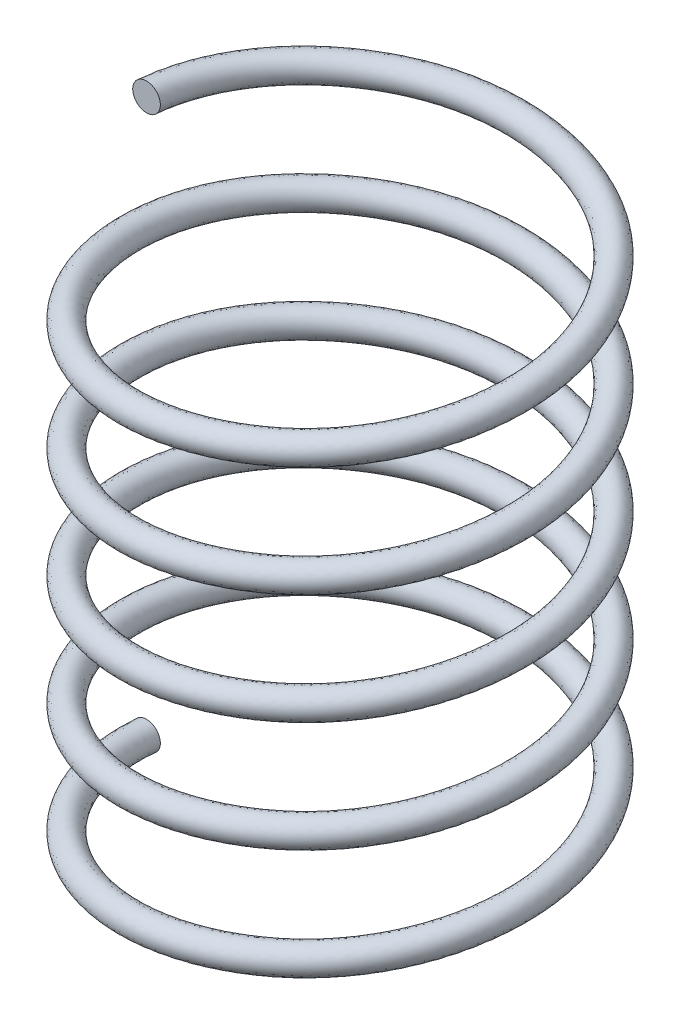
ISO-10303-21;
HEADER;
FILE_DESCRIPTION(('STEP AP214'),'2;1');
FILE_NAME('part.step','',(''),(''),'','','');
FILE_SCHEMA(('AUTOMOTIVE_DESIGN { 1 0 10303 214 1 1 1 1 }'));
ENDSEC;
DATA;
#1=APPLICATION_CONTEXT('core data for automotive mechanical design processes');
#2=APPLICATION_PROTOCOL_DEFINITION('international standard','automotive_design',2000,#1);
#3=PRODUCT_CONTEXT('',#1,'mechanical');
#4=PRODUCT('Part','Part','',(#3));
#5=PRODUCT_RELATED_PRODUCT_CATEGORY('part','',(#4));
#6=PRODUCT_DEFINITION_FORMATION('','',#4);
#7=PRODUCT_DEFINITION_CONTEXT('part definition',#1,'design');
#8=PRODUCT_DEFINITION('design','',#6,#7);
#9=PRODUCT_DEFINITION_SHAPE('','',#8);
#10=(LENGTH_UNIT() NAMED_UNIT(*) SI_UNIT(.MILLI.,.METRE.));
#11=(NAMED_UNIT(*) PLANE_ANGLE_UNIT() SI_UNIT($,.RADIAN.));
#12=(NAMED_UNIT(*) SI_UNIT($,.STERADIAN.) SOLID_ANGLE_UNIT());
#13=UNCERTAINTY_MEASURE_WITH_UNIT(LENGTH_MEASURE(1.E-05),#10,'distance_accuracy_value','');
#14=(GEOMETRIC_REPRESENTATION_CONTEXT(3) GLOBAL_UNCERTAINTY_ASSIGNED_CONTEXT((#13)) GLOBAL_UNIT_ASSIGNED_CONTEXT((#10,
#11,#12)) REPRESENTATION_CONTEXT('',''));
#15=CARTESIAN_POINT('',(0.,0.,0.));
#16=DIRECTION('',(0.,0.,1.));
#17=DIRECTION('',(1.,0.,0.));
#18=AXIS2_PLACEMENT_3D('',#15,#16,#17);
#19=CARTESIAN_POINT('',(0.,0.,0.));
#20=DIRECTION('',(0.,0.,1.));
#21=DIRECTION('',(1.,0.,0.));
#22=AXIS2_PLACEMENT_3D('',#19,#20,#21);
#23=PLANE('',#22);
#24=CARTESIAN_POINT('',(0.,0.,0.));
#25=DIRECTION('',(0.,0.,1.));
#26=DIRECTION('',(1.,0.,0.));
#27=AXIS2_PLACEMENT_3D('',#24,#25,#26);
#28=CIRCLE('',#27,0.5);
#29=CARTESIAN_POINT('',(0.5,0.,0.));
#30=VERTEX_POINT('',#29);
#31=EDGE_CURVE('E42',#30,#30,#28,.T.);
#32=ORIENTED_EDGE('',*,*,#31,.F.);
#33=EDGE_LOOP('',(#32));
#34=FACE_BOUND('',#33,.T.);
#35=ADVANCED_FACE('F35',(#34),#23,.F.);
#36=CARTESIAN_POINT('',(0.,20.,4.88807387438039E-13));
#37=DIRECTION('',(0.,0.,1.));
#38=DIRECTION('',(1.,0.,0.));
#39=AXIS2_PLACEMENT_3D('',#36,#37,#38);
#40=PLANE('',#39);
#41=CARTESIAN_POINT('',(0.,20.,4.88807387438039E-13));
#42=DIRECTION('',(0.,0.,1.));
#43=DIRECTION('',(1.,0.,0.));
#44=AXIS2_PLACEMENT_3D('',#41,#42,#43);
#45=CIRCLE('',#44,0.5);
#46=CARTESIAN_POINT('',(0.5,20.,4.53892574049607E-13));
#47=VERTEX_POINT('',#46);
#48=EDGE_CURVE('E11',#47,#47,#45,.T.);
#49=ORIENTED_EDGE('',*,*,#48,.T.);
#50=EDGE_LOOP('',(#49));
#51=FACE_BOUND('',#50,.T.);
#52=ADVANCED_FACE('F49',(#51),#40,.T.);
#53=CARTESIAN_POINT('',(0.5,0.,0.));
#54=CARTESIAN_POINT('',(0.5,0.333333333333333,3.75277674973257));
#55=CARTESIAN_POINT('',(3.75,0.666666666666665,5.62916512459885));
#56=CARTESIAN_POINT('',(7.,0.999999999999998,7.50555349946513));
#57=CARTESIAN_POINT('',(10.25,1.33333333333333,5.62916512459885));
#58=CARTESIAN_POINT('',(13.5,1.66666666666666,3.75277674973257));
#59=CARTESIAN_POINT('',(13.5,2.,0.));
#60=CARTESIAN_POINT('',(13.5,2.33333333333333,-3.75277674973257));
#61=CARTESIAN_POINT('',(10.25,2.66666666666666,-5.62916512459885));
#62=CARTESIAN_POINT('',(7.,2.99999999999999,-7.50555349946513));
#63=CARTESIAN_POINT('',(3.75000000000001,3.33333333333333,-5.62916512459885));
#64=CARTESIAN_POINT('',(0.500000000000002,3.66666666666666,-3.75277674973257));
#65=CARTESIAN_POINT('',(0.5,3.99999999999999,0.));
#66=CARTESIAN_POINT('',(0.5,4.33333333333332,3.75277674973257));
#67=CARTESIAN_POINT('',(3.75,4.66666666666666,5.62916512459885));
#68=CARTESIAN_POINT('',(7.,4.99999999999999,7.50555349946513));
#69=CARTESIAN_POINT('',(10.25,5.33333333333332,5.62916512459885));
#70=CARTESIAN_POINT('',(13.5,5.66666666666665,3.75277674973257));
#71=CARTESIAN_POINT('',(13.5,5.99999999999999,0.));
#72=CARTESIAN_POINT('',(13.5,6.33333333333332,-3.75277674973257));
#73=CARTESIAN_POINT('',(10.25,6.66666666666665,-5.62916512459885));
#74=CARTESIAN_POINT('',(7.,6.99999999999998,-7.50555349946513));
#75=CARTESIAN_POINT('',(3.75000000000001,7.33333333333332,-5.62916512459885));
#76=CARTESIAN_POINT('',(0.500000000000002,7.66666666666665,-3.75277674973257));
#77=CARTESIAN_POINT('',(0.5,7.99999999999998,0.));
#78=CARTESIAN_POINT('',(0.5,8.33333333333331,3.75277674973257));
#79=CARTESIAN_POINT('',(3.75,8.66666666666665,5.62916512459885));
#80=CARTESIAN_POINT('',(7.,8.99999999999998,7.50555349946513));
#81=CARTESIAN_POINT('',(10.25,9.33333333333331,5.62916512459885));
#82=CARTESIAN_POINT('',(13.5,9.66666666666664,3.75277674973257));
#83=CARTESIAN_POINT('',(13.5,9.99999999999998,0.));
#84=CARTESIAN_POINT('',(13.5,10.3333333333333,-3.75277674973257));
#85=CARTESIAN_POINT('',(10.25,10.6666666666666,-5.62916512459885));
#86=CARTESIAN_POINT('',(7.,11.,-7.50555349946513));
#87=CARTESIAN_POINT('',(3.75000000000001,11.3333333333333,-5.62916512459885));
#88=CARTESIAN_POINT('',(0.500000000000002,11.6666666666666,-3.75277674973257));
#89=CARTESIAN_POINT('',(0.5,12.,0.));
#90=CARTESIAN_POINT('',(0.5,12.3333333333333,3.75277674973257));
#91=CARTESIAN_POINT('',(3.75,12.6666666666666,5.62916512459885));
#92=CARTESIAN_POINT('',(7.,13.,7.50555349946513));
#93=CARTESIAN_POINT('',(10.25,13.3333333333333,5.62916512459885));
#94=CARTESIAN_POINT('',(13.5,13.6666666666666,3.75277674973257));
#95=CARTESIAN_POINT('',(13.5,14.,0.));
#96=CARTESIAN_POINT('',(13.5,14.3333333333333,-3.75277674973257));
#97=CARTESIAN_POINT('',(10.25,14.6666666666666,-5.62916512459885));
#98=CARTESIAN_POINT('',(7.,15.,-7.50555349946513));
#99=CARTESIAN_POINT('',(3.75000000000001,15.3333333333333,-5.62916512459885));
#100=CARTESIAN_POINT('',(0.500000000000002,15.6666666666666,-3.75277674973257));
#101=CARTESIAN_POINT('',(0.5,16.,0.));
#102=CARTESIAN_POINT('',(0.5,16.3333333333333,3.75277674973257));
#103=CARTESIAN_POINT('',(3.75,16.6666666666666,5.62916512459885));
#104=CARTESIAN_POINT('',(7.,17.,7.50555349946513));
#105=CARTESIAN_POINT('',(10.25,17.3333333333333,5.62916512459885));
#106=CARTESIAN_POINT('',(13.5,17.6666666666666,3.75277674973257));
#107=CARTESIAN_POINT('',(13.5,18.,0.));
#108=CARTESIAN_POINT('',(13.5,18.3333333333333,-3.75277674973257));
#109=CARTESIAN_POINT('',(10.25,18.6666666666666,-5.62916512459885));
#110=CARTESIAN_POINT('',(7.,19.,-7.50555349946513));
#111=CARTESIAN_POINT('',(3.75000000000001,19.3333333333333,-5.62916512459885));
#112=CARTESIAN_POINT('',(0.500000000000002,19.6666666666666,-3.75277674973257));
#113=CARTESIAN_POINT('',(0.5,20.,0.));
#114=CARTESIAN_POINT('',(0.5,1.,0.));
#115=CARTESIAN_POINT('',(0.5,1.33333333333333,3.75277674973257));
#116=CARTESIAN_POINT('',(3.75,1.66666666666666,5.62916512459885));
#117=CARTESIAN_POINT('',(7.,2.,7.50555349946513));
#118=CARTESIAN_POINT('',(10.25,2.33333333333333,5.62916512459885));
#119=CARTESIAN_POINT('',(13.5,2.66666666666666,3.75277674973257));
#120=CARTESIAN_POINT('',(13.5,3.,0.));
#121=CARTESIAN_POINT('',(13.5,3.33333333333333,-3.75277674973257));
#122=CARTESIAN_POINT('',(10.25,3.66666666666666,-5.62916512459885));
#123=CARTESIAN_POINT('',(7.,3.99999999999999,-7.50555349946513));
#124=CARTESIAN_POINT('',(3.75000000000001,4.33333333333333,-5.62916512459885));
#125=CARTESIAN_POINT('',(0.500000000000002,4.66666666666666,-3.75277674973257));
#126=CARTESIAN_POINT('',(0.5,4.99999999999999,0.));
#127=CARTESIAN_POINT('',(0.5,5.33333333333332,3.75277674973257));
#128=CARTESIAN_POINT('',(3.75,5.66666666666666,5.62916512459885));
#129=CARTESIAN_POINT('',(7.,5.99999999999999,7.50555349946513));
#130=CARTESIAN_POINT('',(10.25,6.33333333333332,5.62916512459885));
#131=CARTESIAN_POINT('',(13.5,6.66666666666665,3.75277674973257));
#132=CARTESIAN_POINT('',(13.5,6.99999999999999,0.));
#133=CARTESIAN_POINT('',(13.5,7.33333333333332,-3.75277674973257));
#134=CARTESIAN_POINT('',(10.25,7.66666666666665,-5.62916512459885));
#135=CARTESIAN_POINT('',(7.,7.99999999999998,-7.50555349946513));
#136=CARTESIAN_POINT('',(3.75000000000001,8.33333333333332,-5.62916512459885));
#137=CARTESIAN_POINT('',(0.500000000000002,8.66666666666665,-3.75277674973257));
#138=CARTESIAN_POINT('',(0.5,8.99999999999998,0.));
#139=CARTESIAN_POINT('',(0.5,9.33333333333331,3.75277674973257));
#140=CARTESIAN_POINT('',(3.75,9.66666666666665,5.62916512459885));
#141=CARTESIAN_POINT('',(7.,9.99999999999998,7.50555349946513));
#142=CARTESIAN_POINT('',(10.25,10.3333333333333,5.62916512459885));
#143=CARTESIAN_POINT('',(13.5,10.6666666666666,3.75277674973257));
#144=CARTESIAN_POINT('',(13.5,11.,0.));
#145=CARTESIAN_POINT('',(13.5,11.3333333333333,-3.75277674973257));
#146=CARTESIAN_POINT('',(10.25,11.6666666666666,-5.62916512459885));
#147=CARTESIAN_POINT('',(7.,12.,-7.50555349946513));
#148=CARTESIAN_POINT('',(3.75000000000001,12.3333333333333,-5.62916512459885));
#149=CARTESIAN_POINT('',(0.500000000000002,12.6666666666666,-3.75277674973257));
#150=CARTESIAN_POINT('',(0.5,13.,0.));
#151=CARTESIAN_POINT('',(0.5,13.3333333333333,3.75277674973257));
#152=CARTESIAN_POINT('',(3.75,13.6666666666666,5.62916512459885));
#153=CARTESIAN_POINT('',(7.,14.,7.50555349946513));
#154=CARTESIAN_POINT('',(10.25,14.3333333333333,5.62916512459885));
#155=CARTESIAN_POINT('',(13.5,14.6666666666666,3.75277674973257));
#156=CARTESIAN_POINT('',(13.5,15.,0.));
#157=CARTESIAN_POINT('',(13.5,15.3333333333333,-3.75277674973257));
#158=CARTESIAN_POINT('',(10.25,15.6666666666666,-5.62916512459885));
#159=CARTESIAN_POINT('',(7.,16.,-7.50555349946513));
#160=CARTESIAN_POINT('',(3.75000000000001,16.3333333333333,-5.62916512459885));
#161=CARTESIAN_POINT('',(0.500000000000002,16.6666666666666,-3.75277674973257));
#162=CARTESIAN_POINT('',(0.5,17.,0.));
#163=CARTESIAN_POINT('',(0.5,17.3333333333333,3.75277674973257));
#164=CARTESIAN_POINT('',(3.75,17.6666666666666,5.62916512459885));
#165=CARTESIAN_POINT('',(7.,18.,7.50555349946513));
#166=CARTESIAN_POINT('',(10.25,18.3333333333333,5.62916512459885));
#167=CARTESIAN_POINT('',(13.5,18.6666666666666,3.75277674973257));
#168=CARTESIAN_POINT('',(13.5,19.,0.));
#169=CARTESIAN_POINT('',(13.5,19.3333333333333,-3.75277674973257));
#170=CARTESIAN_POINT('',(10.25,19.6666666666666,-5.62916512459885));
#171=CARTESIAN_POINT('',(7.,20.,-7.50555349946513));
#172=CARTESIAN_POINT('',(3.75000000000001,20.3333333333333,-5.62916512459885));
#173=CARTESIAN_POINT('',(0.500000000000002,20.6666666666666,-3.75277674973257));
#174=CARTESIAN_POINT('',(0.5,21.,0.));
#175=CARTESIAN_POINT('',(-0.5,1.,0.));
#176=CARTESIAN_POINT('',(-0.5,1.33333333333333,4.33012701892219));
#177=CARTESIAN_POINT('',(3.25,1.66666666666666,6.49519052838329));
#178=CARTESIAN_POINT('',(7.,2.,8.66025403784439));
#179=CARTESIAN_POINT('',(10.75,2.33333333333333,6.49519052838329));
#180=CARTESIAN_POINT('',(14.5,2.66666666666666,4.3301270189222));
#181=CARTESIAN_POINT('',(14.5,3.,0.));
#182=CARTESIAN_POINT('',(14.5,3.33333333333333,-4.33012701892219));
#183=CARTESIAN_POINT('',(10.75,3.66666666666666,-6.49519052838329));
#184=CARTESIAN_POINT('',(7.,3.99999999999999,-8.66025403784439));
#185=CARTESIAN_POINT('',(3.25000000000001,4.33333333333333,-6.49519052838329));
#186=CARTESIAN_POINT('',(-0.499999999999997,4.66666666666666,-4.3301270189222));
#187=CARTESIAN_POINT('',(-0.5,4.99999999999999,0.));
#188=CARTESIAN_POINT('',(-0.5,5.33333333333332,4.33012701892219));
#189=CARTESIAN_POINT('',(3.25,5.66666666666666,6.49519052838329));
#190=CARTESIAN_POINT('',(7.,5.99999999999999,8.66025403784439));
#191=CARTESIAN_POINT('',(10.75,6.33333333333332,6.49519052838329));
#192=CARTESIAN_POINT('',(14.5,6.66666666666665,4.3301270189222));
#193=CARTESIAN_POINT('',(14.5,6.99999999999999,0.));
#194=CARTESIAN_POINT('',(14.5,7.33333333333332,-4.33012701892219));
#195=CARTESIAN_POINT('',(10.75,7.66666666666665,-6.49519052838329));
#196=CARTESIAN_POINT('',(7.,7.99999999999998,-8.66025403784439));
#197=CARTESIAN_POINT('',(3.25000000000001,8.33333333333332,-6.49519052838329));
#198=CARTESIAN_POINT('',(-0.499999999999997,8.66666666666665,-4.3301270189222));
#199=CARTESIAN_POINT('',(-0.5,8.99999999999998,0.));
#200=CARTESIAN_POINT('',(-0.5,9.33333333333331,4.33012701892219));
#201=CARTESIAN_POINT('',(3.25,9.66666666666665,6.49519052838329));
#202=CARTESIAN_POINT('',(7.,9.99999999999998,8.66025403784439));
#203=CARTESIAN_POINT('',(10.75,10.3333333333333,6.49519052838329));
#204=CARTESIAN_POINT('',(14.5,10.6666666666666,4.3301270189222));
#205=CARTESIAN_POINT('',(14.5,11.,0.));
#206=CARTESIAN_POINT('',(14.5,11.3333333333333,-4.33012701892219));
#207=CARTESIAN_POINT('',(10.75,11.6666666666666,-6.49519052838329));
#208=CARTESIAN_POINT('',(7.,12.,-8.66025403784439));
#209=CARTESIAN_POINT('',(3.25000000000001,12.3333333333333,-6.49519052838329));
#210=CARTESIAN_POINT('',(-0.499999999999997,12.6666666666666,-4.3301270189222));
#211=CARTESIAN_POINT('',(-0.5,13.,0.));
#212=CARTESIAN_POINT('',(-0.5,13.3333333333333,4.33012701892219));
#213=CARTESIAN_POINT('',(3.25,13.6666666666666,6.49519052838329));
#214=CARTESIAN_POINT('',(7.,14.,8.66025403784439));
#215=CARTESIAN_POINT('',(10.75,14.3333333333333,6.49519052838329));
#216=CARTESIAN_POINT('',(14.5,14.6666666666666,4.3301270189222));
#217=CARTESIAN_POINT('',(14.5,15.,0.));
#218=CARTESIAN_POINT('',(14.5,15.3333333333333,-4.33012701892219));
#219=CARTESIAN_POINT('',(10.75,15.6666666666666,-6.49519052838329));
#220=CARTESIAN_POINT('',(7.,16.,-8.66025403784439));
#221=CARTESIAN_POINT('',(3.25000000000001,16.3333333333333,-6.49519052838329));
#222=CARTESIAN_POINT('',(-0.499999999999997,16.6666666666666,-4.3301270189222));
#223=CARTESIAN_POINT('',(-0.5,17.,0.));
#224=CARTESIAN_POINT('',(-0.5,17.3333333333333,4.33012701892219));
#225=CARTESIAN_POINT('',(3.25,17.6666666666666,6.49519052838329));
#226=CARTESIAN_POINT('',(7.,18.,8.66025403784439));
#227=CARTESIAN_POINT('',(10.75,18.3333333333333,6.49519052838329));
#228=CARTESIAN_POINT('',(14.5,18.6666666666666,4.3301270189222));
#229=CARTESIAN_POINT('',(14.5,19.,0.));
#230=CARTESIAN_POINT('',(14.5,19.3333333333333,-4.33012701892219));
#231=CARTESIAN_POINT('',(10.75,19.6666666666666,-6.49519052838329));
#232=CARTESIAN_POINT('',(7.,20.,-8.66025403784439));
#233=CARTESIAN_POINT('',(3.25000000000001,20.3333333333333,-6.49519052838329));
#234=CARTESIAN_POINT('',(-0.499999999999997,20.6666666666666,-4.3301270189222));
#235=CARTESIAN_POINT('',(-0.5,21.,0.));
#236=CARTESIAN_POINT('',(-0.5,0.,0.));
#237=CARTESIAN_POINT('',(-0.5,0.333333333333333,4.33012701892219));
#238=CARTESIAN_POINT('',(3.25,0.666666666666665,6.49519052838329));
#239=CARTESIAN_POINT('',(7.,0.999999999999998,8.66025403784439));
#240=CARTESIAN_POINT('',(10.75,1.33333333333333,6.49519052838329));
#241=CARTESIAN_POINT('',(14.5,1.66666666666666,4.3301270189222));
#242=CARTESIAN_POINT('',(14.5,2.,0.));
#243=CARTESIAN_POINT('',(14.5,2.33333333333333,-4.33012701892219));
#244=CARTESIAN_POINT('',(10.75,2.66666666666666,-6.49519052838329));
#245=CARTESIAN_POINT('',(7.,2.99999999999999,-8.66025403784439));
#246=CARTESIAN_POINT('',(3.25000000000001,3.33333333333333,-6.49519052838329));
#247=CARTESIAN_POINT('',(-0.499999999999998,3.66666666666666,-4.3301270189222));
#248=CARTESIAN_POINT('',(-0.5,3.99999999999999,0.));
#249=CARTESIAN_POINT('',(-0.5,4.33333333333332,4.33012701892219));
#250=CARTESIAN_POINT('',(3.25,4.66666666666666,6.49519052838329));
#251=CARTESIAN_POINT('',(7.,4.99999999999999,8.66025403784439));
#252=CARTESIAN_POINT('',(10.75,5.33333333333332,6.49519052838329));
#253=CARTESIAN_POINT('',(14.5,5.66666666666665,4.3301270189222));
#254=CARTESIAN_POINT('',(14.5,5.99999999999999,0.));
#255=CARTESIAN_POINT('',(14.5,6.33333333333332,-4.33012701892219));
#256=CARTESIAN_POINT('',(10.75,6.66666666666665,-6.49519052838329));
#257=CARTESIAN_POINT('',(7.,6.99999999999998,-8.66025403784439));
#258=CARTESIAN_POINT('',(3.25000000000001,7.33333333333332,-6.49519052838329));
#259=CARTESIAN_POINT('',(-0.499999999999998,7.66666666666665,-4.3301270189222));
#260=CARTESIAN_POINT('',(-0.5,7.99999999999998,0.));
#261=CARTESIAN_POINT('',(-0.5,8.33333333333331,4.33012701892219));
#262=CARTESIAN_POINT('',(3.25,8.66666666666665,6.49519052838329));
#263=CARTESIAN_POINT('',(7.,8.99999999999998,8.66025403784439));
#264=CARTESIAN_POINT('',(10.75,9.33333333333331,6.49519052838329));
#265=CARTESIAN_POINT('',(14.5,9.66666666666664,4.3301270189222));
#266=CARTESIAN_POINT('',(14.5,9.99999999999998,0.));
#267=CARTESIAN_POINT('',(14.5,10.3333333333333,-4.33012701892219));
#268=CARTESIAN_POINT('',(10.75,10.6666666666666,-6.49519052838329));
#269=CARTESIAN_POINT('',(7.,11.,-8.66025403784439));
#270=CARTESIAN_POINT('',(3.25000000000001,11.3333333333333,-6.49519052838329));
#271=CARTESIAN_POINT('',(-0.499999999999998,11.6666666666666,-4.3301270189222));
#272=CARTESIAN_POINT('',(-0.5,12.,0.));
#273=CARTESIAN_POINT('',(-0.5,12.3333333333333,4.33012701892219));
#274=CARTESIAN_POINT('',(3.25,12.6666666666666,6.49519052838329));
#275=CARTESIAN_POINT('',(7.,13.,8.66025403784439));
#276=CARTESIAN_POINT('',(10.75,13.3333333333333,6.49519052838329));
#277=CARTESIAN_POINT('',(14.5,13.6666666666666,4.3301270189222));
#278=CARTESIAN_POINT('',(14.5,14.,0.));
#279=CARTESIAN_POINT('',(14.5,14.3333333333333,-4.33012701892219));
#280=CARTESIAN_POINT('',(10.75,14.6666666666666,-6.49519052838329));
#281=CARTESIAN_POINT('',(7.,15.,-8.66025403784439));
#282=CARTESIAN_POINT('',(3.25000000000001,15.3333333333333,-6.49519052838329));
#283=CARTESIAN_POINT('',(-0.499999999999998,15.6666666666666,-4.3301270189222));
#284=CARTESIAN_POINT('',(-0.5,16.,0.));
#285=CARTESIAN_POINT('',(-0.5,16.3333333333333,4.33012701892219));
#286=CARTESIAN_POINT('',(3.25,16.6666666666666,6.49519052838329));
#287=CARTESIAN_POINT('',(7.,17.,8.66025403784439));
#288=CARTESIAN_POINT('',(10.75,17.3333333333333,6.49519052838329));
#289=CARTESIAN_POINT('',(14.5,17.6666666666666,4.3301270189222));
#290=CARTESIAN_POINT('',(14.5,18.,0.));
#291=CARTESIAN_POINT('',(14.5,18.3333333333333,-4.33012701892219));
#292=CARTESIAN_POINT('',(10.75,18.6666666666666,-6.49519052838329));
#293=CARTESIAN_POINT('',(7.,19.,-8.66025403784439));
#294=CARTESIAN_POINT('',(3.25000000000001,19.3333333333333,-6.49519052838329));
#295=CARTESIAN_POINT('',(-0.499999999999998,19.6666666666666,-4.3301270189222));
#296=CARTESIAN_POINT('',(-0.5,20.,0.));
#297=CARTESIAN_POINT('',(-0.5,-1.,0.));
#298=CARTESIAN_POINT('',(-0.5,-0.666666666666667,4.33012701892219));
#299=CARTESIAN_POINT('',(3.25,-0.333333333333335,6.49519052838329));
#300=CARTESIAN_POINT('',(7.,0.,8.66025403784439));
#301=CARTESIAN_POINT('',(10.75,0.33333333333333,6.49519052838329));
#302=CARTESIAN_POINT('',(14.5,0.666666666666663,4.3301270189222));
#303=CARTESIAN_POINT('',(14.5,0.999999999999995,0.));
#304=CARTESIAN_POINT('',(14.5,1.33333333333333,-4.33012701892219));
#305=CARTESIAN_POINT('',(10.75,1.66666666666666,-6.49519052838329));
#306=CARTESIAN_POINT('',(7.,1.99999999999999,-8.66025403784439));
#307=CARTESIAN_POINT('',(3.25000000000001,2.33333333333333,-6.49519052838329));
#308=CARTESIAN_POINT('',(-0.499999999999998,2.66666666666666,-4.3301270189222));
#309=CARTESIAN_POINT('',(-0.5,2.99999999999999,0.));
#310=CARTESIAN_POINT('',(-0.5,3.33333333333332,4.33012701892219));
#311=CARTESIAN_POINT('',(3.25,3.66666666666666,6.49519052838329));
#312=CARTESIAN_POINT('',(7.,3.99999999999999,8.66025403784439));
#313=CARTESIAN_POINT('',(10.75,4.33333333333332,6.49519052838329));
#314=CARTESIAN_POINT('',(14.5,4.66666666666665,4.3301270189222));
#315=CARTESIAN_POINT('',(14.5,4.99999999999999,0.));
#316=CARTESIAN_POINT('',(14.5,5.33333333333332,-4.33012701892219));
#317=CARTESIAN_POINT('',(10.75,5.66666666666665,-6.49519052838329));
#318=CARTESIAN_POINT('',(7.,5.99999999999998,-8.66025403784439));
#319=CARTESIAN_POINT('',(3.25000000000001,6.33333333333332,-6.49519052838329));
#320=CARTESIAN_POINT('',(-0.499999999999998,6.66666666666665,-4.3301270189222));
#321=CARTESIAN_POINT('',(-0.5,6.99999999999998,0.));
#322=CARTESIAN_POINT('',(-0.5,7.33333333333332,4.33012701892219));
#323=CARTESIAN_POINT('',(3.25,7.66666666666665,6.49519052838329));
#324=CARTESIAN_POINT('',(7.,7.99999999999998,8.66025403784439));
#325=CARTESIAN_POINT('',(10.75,8.33333333333331,6.49519052838329));
#326=CARTESIAN_POINT('',(14.5,8.66666666666665,4.3301270189222));
#327=CARTESIAN_POINT('',(14.5,8.99999999999998,0.));
#328=CARTESIAN_POINT('',(14.5,9.33333333333331,-4.33012701892219));
#329=CARTESIAN_POINT('',(10.75,9.66666666666664,-6.49519052838329));
#330=CARTESIAN_POINT('',(7.,9.99999999999998,-8.66025403784439));
#331=CARTESIAN_POINT('',(3.25000000000001,10.3333333333333,-6.49519052838329));
#332=CARTESIAN_POINT('',(-0.499999999999998,10.6666666666666,-4.3301270189222));
#333=CARTESIAN_POINT('',(-0.5,11.,0.));
#334=CARTESIAN_POINT('',(-0.5,11.3333333333333,4.33012701892219));
#335=CARTESIAN_POINT('',(3.25,11.6666666666666,6.49519052838329));
#336=CARTESIAN_POINT('',(7.,12.,8.66025403784439));
#337=CARTESIAN_POINT('',(10.75,12.3333333333333,6.49519052838329));
#338=CARTESIAN_POINT('',(14.5,12.6666666666666,4.3301270189222));
#339=CARTESIAN_POINT('',(14.5,13.,0.));
#340=CARTESIAN_POINT('',(14.5,13.3333333333333,-4.33012701892219));
#341=CARTESIAN_POINT('',(10.75,13.6666666666666,-6.49519052838329));
#342=CARTESIAN_POINT('',(7.,14.,-8.66025403784439));
#343=CARTESIAN_POINT('',(3.25000000000001,14.3333333333333,-6.49519052838329));
#344=CARTESIAN_POINT('',(-0.499999999999998,14.6666666666666,-4.3301270189222));
#345=CARTESIAN_POINT('',(-0.5,15.,0.));
#346=CARTESIAN_POINT('',(-0.5,15.3333333333333,4.33012701892219));
#347=CARTESIAN_POINT('',(3.25,15.6666666666666,6.49519052838329));
#348=CARTESIAN_POINT('',(7.,16.,8.66025403784439));
#349=CARTESIAN_POINT('',(10.75,16.3333333333333,6.49519052838329));
#350=CARTESIAN_POINT('',(14.5,16.6666666666666,4.3301270189222));
#351=CARTESIAN_POINT('',(14.5,17.,0.));
#352=CARTESIAN_POINT('',(14.5,17.3333333333333,-4.33012701892219));
#353=CARTESIAN_POINT('',(10.75,17.6666666666666,-6.49519052838329));
#354=CARTESIAN_POINT('',(7.,18.,-8.66025403784439));
#355=CARTESIAN_POINT('',(3.25000000000001,18.3333333333333,-6.49519052838329));
#356=CARTESIAN_POINT('',(-0.499999999999998,18.6666666666666,-4.3301270189222));
#357=CARTESIAN_POINT('',(-0.5,19.,0.));
#358=CARTESIAN_POINT('',(0.5,-1.,0.));
#359=CARTESIAN_POINT('',(0.5,-0.666666666666667,3.75277674973257));
#360=CARTESIAN_POINT('',(3.75,-0.333333333333335,5.62916512459885));
#361=CARTESIAN_POINT('',(7.,0.,7.50555349946513));
#362=CARTESIAN_POINT('',(10.25,0.33333333333333,5.62916512459885));
#363=CARTESIAN_POINT('',(13.5,0.666666666666663,3.75277674973257));
#364=CARTESIAN_POINT('',(13.5,0.999999999999995,0.));
#365=CARTESIAN_POINT('',(13.5,1.33333333333333,-3.75277674973257));
#366=CARTESIAN_POINT('',(10.25,1.66666666666666,-5.62916512459885));
#367=CARTESIAN_POINT('',(7.,1.99999999999999,-7.50555349946513));
#368=CARTESIAN_POINT('',(3.75000000000001,2.33333333333333,-5.62916512459885));
#369=CARTESIAN_POINT('',(0.500000000000002,2.66666666666666,-3.75277674973257));
#370=CARTESIAN_POINT('',(0.5,2.99999999999999,0.));
#371=CARTESIAN_POINT('',(0.5,3.33333333333332,3.75277674973257));
#372=CARTESIAN_POINT('',(3.75,3.66666666666666,5.62916512459885));
#373=CARTESIAN_POINT('',(7.,3.99999999999999,7.50555349946513));
#374=CARTESIAN_POINT('',(10.25,4.33333333333332,5.62916512459885));
#375=CARTESIAN_POINT('',(13.5,4.66666666666665,3.75277674973257));
#376=CARTESIAN_POINT('',(13.5,4.99999999999999,0.));
#377=CARTESIAN_POINT('',(13.5,5.33333333333332,-3.75277674973257));
#378=CARTESIAN_POINT('',(10.25,5.66666666666665,-5.62916512459885));
#379=CARTESIAN_POINT('',(7.,5.99999999999998,-7.50555349946513));
#380=CARTESIAN_POINT('',(3.75000000000001,6.33333333333332,-5.62916512459885));
#381=CARTESIAN_POINT('',(0.500000000000002,6.66666666666665,-3.75277674973257));
#382=CARTESIAN_POINT('',(0.5,6.99999999999998,0.));
#383=CARTESIAN_POINT('',(0.5,7.33333333333332,3.75277674973257));
#384=CARTESIAN_POINT('',(3.75,7.66666666666665,5.62916512459885));
#385=CARTESIAN_POINT('',(7.,7.99999999999998,7.50555349946513));
#386=CARTESIAN_POINT('',(10.25,8.33333333333331,5.62916512459885));
#387=CARTESIAN_POINT('',(13.5,8.66666666666665,3.75277674973257));
#388=CARTESIAN_POINT('',(13.5,8.99999999999998,0.));
#389=CARTESIAN_POINT('',(13.5,9.33333333333331,-3.75277674973257));
#390=CARTESIAN_POINT('',(10.25,9.66666666666664,-5.62916512459885));
#391=CARTESIAN_POINT('',(7.,9.99999999999998,-7.50555349946513));
#392=CARTESIAN_POINT('',(3.75000000000001,10.3333333333333,-5.62916512459885));
#393=CARTESIAN_POINT('',(0.500000000000002,10.6666666666666,-3.75277674973257));
#394=CARTESIAN_POINT('',(0.5,11.,0.));
#395=CARTESIAN_POINT('',(0.5,11.3333333333333,3.75277674973257));
#396=CARTESIAN_POINT('',(3.75,11.6666666666666,5.62916512459885));
#397=CARTESIAN_POINT('',(7.,12.,7.50555349946513));
#398=CARTESIAN_POINT('',(10.25,12.3333333333333,5.62916512459885));
#399=CARTESIAN_POINT('',(13.5,12.6666666666666,3.75277674973257));
#400=CARTESIAN_POINT('',(13.5,13.,0.));
#401=CARTESIAN_POINT('',(13.5,13.3333333333333,-3.75277674973257));
#402=CARTESIAN_POINT('',(10.25,13.6666666666666,-5.62916512459885));
#403=CARTESIAN_POINT('',(7.,14.,-7.50555349946513));
#404=CARTESIAN_POINT('',(3.75000000000001,14.3333333333333,-5.62916512459885));
#405=CARTESIAN_POINT('',(0.500000000000002,14.6666666666666,-3.75277674973257));
#406=CARTESIAN_POINT('',(0.5,15.,0.));
#407=CARTESIAN_POINT('',(0.5,15.3333333333333,3.75277674973257));
#408=CARTESIAN_POINT('',(3.75,15.6666666666666,5.62916512459885));
#409=CARTESIAN_POINT('',(7.,16.,7.50555349946513));
#410=CARTESIAN_POINT('',(10.25,16.3333333333333,5.62916512459885));
#411=CARTESIAN_POINT('',(13.5,16.6666666666666,3.75277674973257));
#412=CARTESIAN_POINT('',(13.5,17.,0.));
#413=CARTESIAN_POINT('',(13.5,17.3333333333333,-3.75277674973257));
#414=CARTESIAN_POINT('',(10.25,17.6666666666666,-5.62916512459885));
#415=CARTESIAN_POINT('',(7.,18.,-7.50555349946513));
#416=CARTESIAN_POINT('',(3.75000000000001,18.3333333333333,-5.62916512459885));
#417=CARTESIAN_POINT('',(0.500000000000002,18.6666666666666,-3.75277674973257));
#418=CARTESIAN_POINT('',(0.5,19.,0.));
#419=CARTESIAN_POINT('',(0.5,0.,0.));
#420=CARTESIAN_POINT('',(0.5,0.333333333333333,3.75277674973257));
#421=CARTESIAN_POINT('',(3.75,0.666666666666665,5.62916512459885));
#422=CARTESIAN_POINT('',(7.,0.999999999999998,7.50555349946513));
#423=CARTESIAN_POINT('',(10.25,1.33333333333333,5.62916512459885));
#424=CARTESIAN_POINT('',(13.5,1.66666666666666,3.75277674973257));
#425=CARTESIAN_POINT('',(13.5,2.,0.));
#426=CARTESIAN_POINT('',(13.5,2.33333333333333,-3.75277674973257));
#427=CARTESIAN_POINT('',(10.25,2.66666666666666,-5.62916512459885));
#428=CARTESIAN_POINT('',(7.,2.99999999999999,-7.50555349946513));
#429=CARTESIAN_POINT('',(3.75000000000001,3.33333333333333,-5.62916512459885));
#430=CARTESIAN_POINT('',(0.500000000000002,3.66666666666666,-3.75277674973257));
#431=CARTESIAN_POINT('',(0.5,3.99999999999999,0.));
#432=CARTESIAN_POINT('',(0.5,4.33333333333332,3.75277674973257));
#433=CARTESIAN_POINT('',(3.75,4.66666666666666,5.62916512459885));
#434=CARTESIAN_POINT('',(7.,4.99999999999999,7.50555349946513));
#435=CARTESIAN_POINT('',(10.25,5.33333333333332,5.62916512459885));
#436=CARTESIAN_POINT('',(13.5,5.66666666666665,3.75277674973257));
#437=CARTESIAN_POINT('',(13.5,5.99999999999999,0.));
#438=CARTESIAN_POINT('',(13.5,6.33333333333332,-3.75277674973257));
#439=CARTESIAN_POINT('',(10.25,6.66666666666665,-5.62916512459885));
#440=CARTESIAN_POINT('',(7.,6.99999999999998,-7.50555349946513));
#441=CARTESIAN_POINT('',(3.75000000000001,7.33333333333332,-5.62916512459885));
#442=CARTESIAN_POINT('',(0.500000000000002,7.66666666666665,-3.75277674973257));
#443=CARTESIAN_POINT('',(0.5,7.99999999999998,0.));
#444=CARTESIAN_POINT('',(0.5,8.33333333333331,3.75277674973257));
#445=CARTESIAN_POINT('',(3.75,8.66666666666665,5.62916512459885));
#446=CARTESIAN_POINT('',(7.,8.99999999999998,7.50555349946513));
#447=CARTESIAN_POINT('',(10.25,9.33333333333331,5.62916512459885));
#448=CARTESIAN_POINT('',(13.5,9.66666666666664,3.75277674973257));
#449=CARTESIAN_POINT('',(13.5,9.99999999999998,0.));
#450=CARTESIAN_POINT('',(13.5,10.3333333333333,-3.75277674973257));
#451=CARTESIAN_POINT('',(10.25,10.6666666666666,-5.62916512459885));
#452=CARTESIAN_POINT('',(7.,11.,-7.50555349946513));
#453=CARTESIAN_POINT('',(3.75000000000001,11.3333333333333,-5.62916512459885));
#454=CARTESIAN_POINT('',(0.500000000000002,11.6666666666666,-3.75277674973257));
#455=CARTESIAN_POINT('',(0.5,12.,0.));
#456=CARTESIAN_POINT('',(0.5,12.3333333333333,3.75277674973257));
#457=CARTESIAN_POINT('',(3.75,12.6666666666666,5.62916512459885));
#458=CARTESIAN_POINT('',(7.,13.,7.50555349946513));
#459=CARTESIAN_POINT('',(10.25,13.3333333333333,5.62916512459885));
#460=CARTESIAN_POINT('',(13.5,13.6666666666666,3.75277674973257));
#461=CARTESIAN_POINT('',(13.5,14.,0.));
#462=CARTESIAN_POINT('',(13.5,14.3333333333333,-3.75277674973257));
#463=CARTESIAN_POINT('',(10.25,14.6666666666666,-5.62916512459885));
#464=CARTESIAN_POINT('',(7.,15.,-7.50555349946513));
#465=CARTESIAN_POINT('',(3.75000000000001,15.3333333333333,-5.62916512459885));
#466=CARTESIAN_POINT('',(0.500000000000002,15.6666666666666,-3.75277674973257));
#467=CARTESIAN_POINT('',(0.5,16.,0.));
#468=CARTESIAN_POINT('',(0.5,16.3333333333333,3.75277674973257));
#469=CARTESIAN_POINT('',(3.75,16.6666666666666,5.62916512459885));
#470=CARTESIAN_POINT('',(7.,17.,7.50555349946513));
#471=CARTESIAN_POINT('',(10.25,17.3333333333333,5.62916512459885));
#472=CARTESIAN_POINT('',(13.5,17.6666666666666,3.75277674973257));
#473=CARTESIAN_POINT('',(13.5,18.,0.));
#474=CARTESIAN_POINT('',(13.5,18.3333333333333,-3.75277674973257));
#475=CARTESIAN_POINT('',(10.25,18.6666666666666,-5.62916512459885));
#476=CARTESIAN_POINT('',(7.,19.,-7.50555349946513));
#477=CARTESIAN_POINT('',(3.75000000000001,19.3333333333333,-5.62916512459885));
#478=CARTESIAN_POINT('',(0.500000000000002,19.6666666666666,-3.75277674973257));
#479=CARTESIAN_POINT('',(0.5,20.,0.));
#480=(BOUNDED_SURFACE() B_SPLINE_SURFACE(3,2,((#53,#54,#55,#56,#57,#58,#59,#60,#61,#62,#63,#64,
#65,#66,#67,#68,#69,#70,#71,#72,#73,#74,#75,#76,#77,#78,#79,#80,#81,#82,#83,#84,#85,#86,#87,#88,
#89,#90,#91,#92,#93,#94,#95,#96,#97,#98,#99,#100,#101,#102,#103,#104,#105,#106,#107,#108,#109,
#110,#111,#112,#113),(#114,#115,#116,#117,#118,#119,#120,#121,#122,#123,#124,#125,#126,#127,
#128,#129,#130,#131,#132,#133,#134,#135,#136,#137,#138,#139,#140,#141,#142,#143,#144,#145,#146,
#147,#148,#149,#150,#151,#152,#153,#154,#155,#156,#157,#158,#159,#160,#161,#162,#163,#164,#165,
#166,#167,#168,#169,#170,#171,#172,#173,#174),(#175,#176,#177,#178,#179,#180,#181,#182,#183,
#184,#185,#186,#187,#188,#189,#190,#191,#192,#193,#194,#195,#196,#197,#198,#199,#200,#201,#202,
#203,#204,#205,#206,#207,#208,#209,#210,#211,#212,#213,#214,#215,#216,#217,#218,#219,#220,#221,
#222,#223,#224,#225,#226,#227,#228,#229,#230,#231,#232,#233,#234,#235),(#236,#237,#238,#239,
#240,#241,#242,#243,#244,#245,#246,#247,#248,#249,#250,#251,#252,#253,#254,#255,#256,#257,#258,
#259,#260,#261,#262,#263,#264,#265,#266,#267,#268,#269,#270,#271,#272,#273,#274,#275,#276,#277,
#278,#279,#280,#281,#282,#283,#284,#285,#286,#287,#288,#289,#290,#291,#292,#293,#294,#295,#296),
(#297,#298,#299,#300,#301,#302,#303,#304,#305,#306,#307,#308,#309,#310,#311,#312,#313,#314,#315,
#316,#317,#318,#319,#320,#321,#322,#323,#324,#325,#326,#327,#328,#329,#330,#331,#332,#333,#334,
#335,#336,#337,#338,#339,#340,#341,#342,#343,#344,#345,#346,#347,#348,#349,#350,#351,#352,#353,
#354,#355,#356,#357),(#358,#359,#360,#361,#362,#363,#364,#365,#366,#367,#368,#369,#370,#371,
#372,#373,#374,#375,#376,#377,#378,#379,#380,#381,#382,#383,#384,#385,#386,#387,#388,#389,#390,
#391,#392,#393,#394,#395,#396,#397,#398,#399,#400,#401,#402,#403,#404,#405,#406,#407,#408,#409,
#410,#411,#412,#413,#414,#415,#416,#417,#418),(#419,#420,#421,#422,#423,#424,#425,#426,#427,
#428,#429,#430,#431,#432,#433,#434,#435,#436,#437,#438,#439,#440,#441,#442,#443,#444,#445,#446,
#447,#448,#449,#450,#451,#452,#453,#454,#455,#456,#457,#458,#459,#460,#461,#462,#463,#464,#465,
#466,#467,#468,#469,#470,#471,#472,#473,#474,#475,#476,#477,#478,#479)),.UNSPECIFIED.,.T.,.F.,
.F.) B_SPLINE_SURFACE_WITH_KNOTS((4,3,4),(3,2,2,2,2,2,2,2,2,2,2,2,2,2,2,2,2,2,2,2,2,2,2,2,2,2,2,
2,2,2,3),(0.,0.5,1.),(0.,0.0333333333333333,0.0666666666666667,0.1,0.133333333333333,
0.166666666666667,0.2,0.233333333333333,0.266666666666667,0.3,0.333333333333333,
0.366666666666667,0.4,0.433333333333333,0.466666666666667,0.5,0.533333333333333,
0.566666666666667,0.6,0.633333333333333,0.666666666666667,0.7,0.733333333333333,
0.766666666666667,0.8,0.833333333333333,0.866666666666667,0.9,0.933333333333333,
0.966666666666667,1.),
.UNSPECIFIED.) GEOMETRIC_REPRESENTATION_ITEM() RATIONAL_B_SPLINE_SURFACE(((1.,0.866025403784439,
1.,0.866025403784439,1.,0.866025403784439,1.,0.866025403784439,1.,0.866025403784439,1.,
0.866025403784439,1.,0.866025403784439,1.,0.866025403784439,1.,0.866025403784439,1.,
0.866025403784439,1.,0.866025403784439,1.,0.866025403784439,1.,0.866025403784439,1.,
0.866025403784439,1.,0.866025403784439,1.,0.866025403784439,1.,0.866025403784439,1.,
0.866025403784439,1.,0.866025403784439,1.,0.866025403784439,1.,0.866025403784439,1.,
0.866025403784439,1.,0.866025403784439,1.,0.866025403784439,1.,0.866025403784439,1.,
0.866025403784439,1.,0.866025403784439,1.,0.866025403784439,1.,0.866025403784439,1.,
0.866025403784439,1.),(0.333333333333333,0.288675134594813,0.333333333333333,0.288675134594813,
0.333333333333333,0.288675134594813,0.333333333333333,0.288675134594813,0.333333333333333,
0.288675134594813,0.333333333333333,0.288675134594813,0.333333333333333,0.288675134594813,
0.333333333333333,0.288675134594813,0.333333333333333,0.288675134594813,0.333333333333333,
0.288675134594813,0.333333333333333,0.288675134594813,0.333333333333333,0.288675134594813,
0.333333333333333,0.288675134594813,0.333333333333333,0.288675134594813,0.333333333333333,
0.288675134594813,0.333333333333333,0.288675134594813,0.333333333333333,0.288675134594813,
0.333333333333333,0.288675134594813,0.333333333333333,0.288675134594813,0.333333333333333,
0.288675134594813,0.333333333333333,0.288675134594813,0.333333333333333,0.288675134594813,
0.333333333333333,0.288675134594813,0.333333333333333,0.288675134594813,0.333333333333333,
0.288675134594813,0.333333333333333,0.288675134594813,0.333333333333333,0.288675134594813,
0.333333333333333,0.288675134594813,0.333333333333333,0.288675134594813,0.333333333333333,
0.288675134594813,0.333333333333333),(0.333333333333333,0.288675134594813,0.333333333333333,
0.288675134594813,0.333333333333333,0.288675134594813,0.333333333333333,0.288675134594813,
0.333333333333333,0.288675134594813,0.333333333333333,0.288675134594813,0.333333333333333,
0.288675134594813,0.333333333333333,0.288675134594813,0.333333333333333,0.288675134594813,
0.333333333333333,0.288675134594813,0.333333333333333,0.288675134594813,0.333333333333333,
0.288675134594813,0.333333333333333,0.288675134594813,0.333333333333333,0.288675134594813,
0.333333333333333,0.288675134594813,0.333333333333333,0.288675134594813,0.333333333333333,
0.288675134594813,0.333333333333333,0.288675134594813,0.333333333333333,0.288675134594813,
0.333333333333333,0.288675134594813,0.333333333333333,0.288675134594813,0.333333333333333,
0.288675134594813,0.333333333333333,0.288675134594813,0.333333333333333,0.288675134594813,
0.333333333333333,0.288675134594813,0.333333333333333,0.288675134594813,0.333333333333333,
0.288675134594813,0.333333333333333,0.288675134594813,0.333333333333333,0.288675134594813,
0.333333333333333,0.288675134594813,0.333333333333333),(1.,0.866025403784439,1.,
0.866025403784439,1.,0.866025403784439,1.,0.866025403784439,1.,0.866025403784439,1.,
0.866025403784439,1.,0.866025403784439,1.,0.866025403784439,1.,0.866025403784439,1.,
0.866025403784439,1.,0.866025403784439,1.,0.866025403784439,1.,0.866025403784439,1.,
0.866025403784439,1.,0.866025403784439,1.,0.866025403784439,1.,0.866025403784439,1.,
0.866025403784439,1.,0.866025403784439,1.,0.866025403784439,1.,0.866025403784439,1.,
0.866025403784439,1.,0.866025403784439,1.,0.866025403784439,1.,0.866025403784439,1.,
0.866025403784439,1.,0.866025403784439,1.,0.866025403784439,1.,0.866025403784439,1.,
0.866025403784439,1.),(0.333333333333333,0.288675134594813,0.333333333333333,0.288675134594813,
0.333333333333333,0.288675134594813,0.333333333333333,0.288675134594813,0.333333333333333,
0.288675134594813,0.333333333333333,0.288675134594813,0.333333333333333,0.288675134594813,
0.333333333333333,0.288675134594813,0.333333333333333,0.288675134594813,0.333333333333333,
0.288675134594813,0.333333333333333,0.288675134594813,0.333333333333333,0.288675134594813,
0.333333333333333,0.288675134594813,0.333333333333333,0.288675134594813,0.333333333333333,
0.288675134594813,0.333333333333333,0.288675134594813,0.333333333333333,0.288675134594813,
0.333333333333333,0.288675134594813,0.333333333333333,0.288675134594813,0.333333333333333,
0.288675134594813,0.333333333333333,0.288675134594813,0.333333333333333,0.288675134594813,
0.333333333333333,0.288675134594813,0.333333333333333,0.288675134594813,0.333333333333333,
0.288675134594813,0.333333333333333,0.288675134594813,0.333333333333333,0.288675134594813,
0.333333333333333,0.288675134594813,0.333333333333333,0.288675134594813,0.333333333333333,
0.288675134594813,0.333333333333333),(0.333333333333333,0.288675134594813,0.333333333333333,
0.288675134594813,0.333333333333333,0.288675134594813,0.333333333333333,0.288675134594813,
0.333333333333333,0.288675134594813,0.333333333333333,0.288675134594813,0.333333333333333,
0.288675134594813,0.333333333333333,0.288675134594813,0.333333333333333,0.288675134594813,
0.333333333333333,0.288675134594813,0.333333333333333,0.288675134594813,0.333333333333333,
0.288675134594813,0.333333333333333,0.288675134594813,0.333333333333333,0.288675134594813,
0.333333333333333,0.288675134594813,0.333333333333333,0.288675134594813,0.333333333333333,
0.288675134594813,0.333333333333333,0.288675134594813,0.333333333333333,0.288675134594813,
0.333333333333333,0.288675134594813,0.333333333333333,0.288675134594813,0.333333333333333,
0.288675134594813,0.333333333333333,0.288675134594813,0.333333333333333,0.288675134594813,
0.333333333333333,0.288675134594813,0.333333333333333,0.288675134594813,0.333333333333333,
0.288675134594813,0.333333333333333,0.288675134594813,0.333333333333333,0.288675134594813,
0.333333333333333,0.288675134594813,0.333333333333333),(1.,0.866025403784439,1.,
0.866025403784439,1.,0.866025403784439,1.,0.866025403784439,1.,0.866025403784439,1.,
0.866025403784439,1.,0.866025403784439,1.,0.866025403784439,1.,0.866025403784439,1.,
0.866025403784439,1.,0.866025403784439,1.,0.866025403784439,1.,0.866025403784439,1.,
0.866025403784439,1.,0.866025403784439,1.,0.866025403784439,1.,0.866025403784439,1.,
0.866025403784439,1.,0.866025403784439,1.,0.866025403784439,1.,0.866025403784439,1.,
0.866025403784439,1.,0.866025403784439,1.,0.866025403784439,1.,0.866025403784439,1.,
0.866025403784439,1.,0.866025403784439,1.,0.866025403784439,1.,0.866025403784439,1.,
0.866025403784439,1.))) REPRESENTATION_ITEM('') SURFACE());
#481=ORIENTED_EDGE('',*,*,#48,.F.);
#482=EDGE_LOOP('',(#481));
#483=FACE_BOUND('',#482,.T.);
#484=ORIENTED_EDGE('',*,*,#31,.T.);
#485=EDGE_LOOP('',(#484));
#486=FACE_BOUND('',#485,.T.);
#487=ADVANCED_FACE('F51',(#483,#486),#480,.T.);
#488=CLOSED_SHELL('',(#35,#52,#487));
#489=MANIFOLD_SOLID_BREP('B2',#488);
#490=ADVANCED_BREP_SHAPE_REPRESENTATION('',(#18,#489),#14);
#491=SHAPE_DEFINITION_REPRESENTATION(#9,#490);
ENDSEC;
END-ISO-10303-21;
